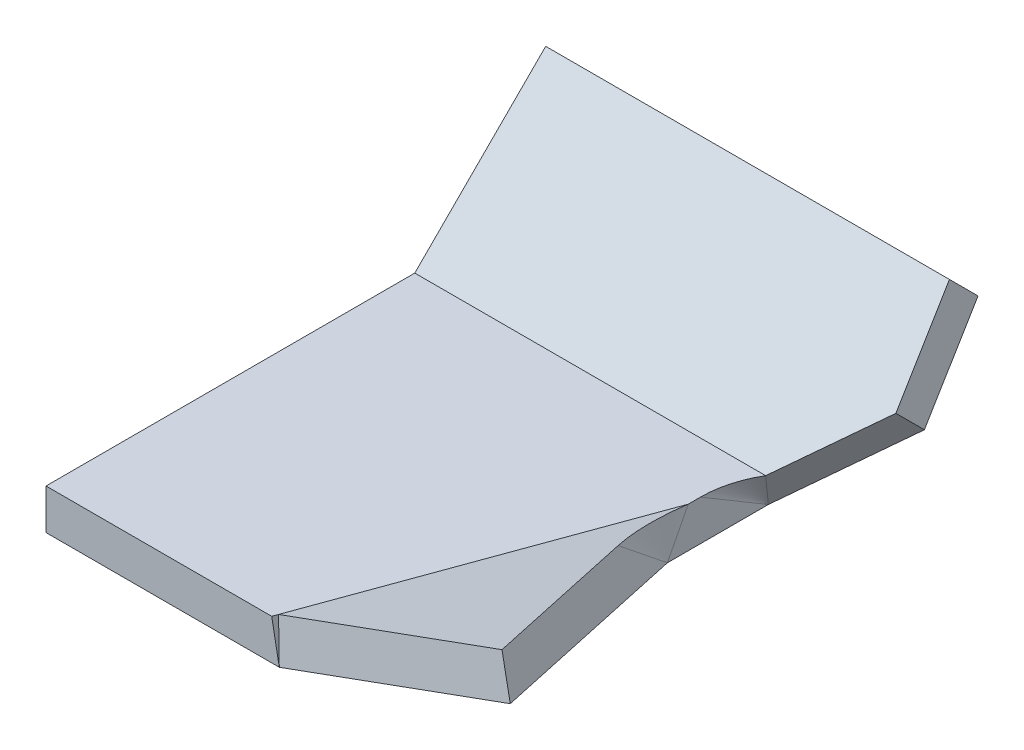
ISO-10303-21;
HEADER;
FILE_DESCRIPTION(('STEP AP214'),'2;1');
FILE_NAME('part.step','',(''),(''),'','','');
FILE_SCHEMA(('AUTOMOTIVE_DESIGN { 1 0 10303 214 1 1 1 1 }'));
ENDSEC;
DATA;
#1=APPLICATION_CONTEXT('core data for automotive mechanical design processes');
#2=APPLICATION_PROTOCOL_DEFINITION('international standard','automotive_design',2000,#1);
#3=PRODUCT_CONTEXT('',#1,'mechanical');
#4=PRODUCT('Part','Part','',(#3));
#5=PRODUCT_RELATED_PRODUCT_CATEGORY('part','',(#4));
#6=PRODUCT_DEFINITION_FORMATION('','',#4);
#7=PRODUCT_DEFINITION_CONTEXT('part definition',#1,'design');
#8=PRODUCT_DEFINITION('design','',#6,#7);
#9=PRODUCT_DEFINITION_SHAPE('','',#8);
#10=(LENGTH_UNIT() NAMED_UNIT(*) SI_UNIT(.MILLI.,.METRE.));
#11=(NAMED_UNIT(*) PLANE_ANGLE_UNIT() SI_UNIT($,.RADIAN.));
#12=(NAMED_UNIT(*) SI_UNIT($,.STERADIAN.) SOLID_ANGLE_UNIT());
#13=UNCERTAINTY_MEASURE_WITH_UNIT(LENGTH_MEASURE(1.E-05),#10,'distance_accuracy_value','');
#14=(GEOMETRIC_REPRESENTATION_CONTEXT(3) GLOBAL_UNCERTAINTY_ASSIGNED_CONTEXT((#13)) GLOBAL_UNIT_ASSIGNED_CONTEXT((#10,
#11,#12)) REPRESENTATION_CONTEXT('',''));
#15=CARTESIAN_POINT('',(0.,0.,0.));
#16=DIRECTION('',(0.,0.,1.));
#17=DIRECTION('',(1.,0.,0.));
#18=AXIS2_PLACEMENT_3D('',#15,#16,#17);
#19=CARTESIAN_POINT('',(0.,0.,0.));
#20=DIRECTION('',(-1.,0.,0.));
#21=DIRECTION('',(0.,0.,-1.));
#22=AXIS2_PLACEMENT_3D('',#19,#20,#21);
#23=PLANE('',#22);
#24=DIRECTION('',(0.,0.88883191143433,-0.458233382913112));
#25=VECTOR('',#24,1.);
#26=CARTESIAN_POINT('',(0.,10.,44.8445439793712));
#27=LINE('',#26,#25);
#28=CARTESIAN_POINT('',(0.,0.,50.));
#29=VERTEX_POINT('',#28);
#30=CARTESIAN_POINT('',(0.,20.,39.6890879587424));
#31=VERTEX_POINT('',#30);
#32=EDGE_CURVE('E309',#29,#31,#27,.T.);
#33=ORIENTED_EDGE('',*,*,#32,.F.);
#34=DIRECTION('',(0.,0.,-1.));
#35=VECTOR('',#34,1.);
#36=CARTESIAN_POINT('',(0.,0.,0.));
#37=LINE('',#36,#35);
#38=CARTESIAN_POINT('',(0.,0.,0.));
#39=VERTEX_POINT('',#38);
#40=EDGE_CURVE('E307',#29,#39,#37,.T.);
#41=ORIENTED_EDGE('',*,*,#40,.T.);
#42=DIRECTION('',(0.,-0.511228267578855,-0.859444971146101));
#43=VECTOR('',#42,1.);
#44=CARTESIAN_POINT('',(0.,10.,16.8113742069932));
#45=LINE('',#44,#43);
#46=CARTESIAN_POINT('',(0.,20.,33.6227484139865));
#47=VERTEX_POINT('',#46);
#48=EDGE_CURVE('E167',#47,#39,#45,.T.);
#49=ORIENTED_EDGE('',*,*,#48,.F.);
#50=DIRECTION('',(0.,0.,-1.));
#51=VECTOR('',#50,1.);
#52=CARTESIAN_POINT('',(0.,20.,0.));
#53=LINE('',#52,#51);
#54=EDGE_CURVE('E338',#31,#47,#53,.T.);
#55=ORIENTED_EDGE('',*,*,#54,.F.);
#56=EDGE_LOOP('',(#33,#41,#49,#55));
#57=FACE_BOUND('',#56,.T.);
#58=ADVANCED_FACE('F61',(#57),#23,.F.);
#59=CARTESIAN_POINT('',(41.9549815588638,35.3553390593274,-35.3553390593273));
#60=DIRECTION('',(-0.766044443118979,0.454519477672043,-0.454519477672042));
#61=DIRECTION('',(-0.642787609686538,-0.541675220419704,0.541675220419702));
#62=AXIS2_PLACEMENT_3D('',#59,#60,#61);
#63=PLANE('',#62);
#64=DIRECTION('',(-0.305733845240658,-0.879641425441802,-0.364359408443197));
#65=VECTOR('',#64,1.);
#66=CARTESIAN_POINT('',(6.95132894831783,20.,8.28427124746192));
#67=LINE('',#66,#65);
#68=CARTESIAN_POINT('',(6.95132894831783,20.,8.28427124746192));
#69=VERTEX_POINT('',#68);
#70=EDGE_CURVE('E173',#69,#39,#67,.T.);
#71=ORIENTED_EDGE('',*,*,#70,.T.);
#72=DIRECTION('',(-0.642787609686538,-0.541675220419704,0.541675220419702));
#73=VECTOR('',#72,1.);
#74=CARTESIAN_POINT('',(41.9549815588638,35.3553390593274,-35.3553390593273));
#75=LINE('',#74,#73);
#76=CARTESIAN_POINT('',(41.9549815588638,35.3553390593274,-35.3553390593273));
#77=VERTEX_POINT('',#76);
#78=EDGE_CURVE('E288',#77,#39,#75,.T.);
#79=ORIENTED_EDGE('',*,*,#78,.F.);
#80=DIRECTION('',(0.,-0.707106781186546,-0.707106781186549));
#81=VECTOR('',#80,1.);
#82=CARTESIAN_POINT('',(41.9549815588638,35.3553390593274,-35.3553390593273));
#83=LINE('',#82,#81);
#84=CARTESIAN_POINT('',(41.9549815588638,49.4974746830584,-21.2132034355963));
#85=VERTEX_POINT('',#84);
#86=EDGE_CURVE('E12',#85,#77,#83,.T.);
#87=ORIENTED_EDGE('',*,*,#86,.F.);
#88=DIRECTION('',(-0.642787609686538,-0.541675220419704,0.541675220419702));
#89=VECTOR('',#88,1.);
#90=CARTESIAN_POINT('',(41.9549815588638,49.4974746830584,-21.2132034355963));
#91=LINE('',#90,#89);
#92=EDGE_CURVE('E291',#85,#69,#91,.T.);
#93=ORIENTED_EDGE('',*,*,#92,.T.);
#94=EDGE_LOOP('',(#71,#79,#87,#93));
#95=FACE_BOUND('',#94,.T.);
#96=ADVANCED_FACE('F277',(#95),#63,.F.);
#97=CARTESIAN_POINT('',(0.,0.,50.));
#98=DIRECTION('',(-0.8662357634511,-0.241844762647975,0.437203285552654));
#99=DIRECTION('',(-0.38254623815515,-0.241844762647976,-0.891722763224696));
#100=AXIS2_PLACEMENT_3D('',#97,#98,#99);
#101=PLANE('',#100);
#102=DIRECTION('',(0.198129189759561,0.637032993641166,0.7449387821679));
#103=VECTOR('',#102,1.);
#104=CARTESIAN_POINT('',(0.,0.,50.));
#105=LINE('',#104,#103);
#106=CARTESIAN_POINT('',(8.84907420148737,28.4519016928662,83.2713143730566));
#107=VERTEX_POINT('',#106);
#108=EDGE_CURVE('E80',#29,#107,#105,.T.);
#109=ORIENTED_EDGE('',*,*,#108,.T.);
#110=DIRECTION('',(-0.38254623815515,-0.241844762647976,-0.891722763224696));
#111=VECTOR('',#110,1.);
#112=CARTESIAN_POINT('',(-6.4278760968654,18.7938524157182,47.6604444311898));
#113=LINE('',#112,#111);
#114=CARTESIAN_POINT('',(52.0660426463178,55.7735596610884,184.010913083184));
#115=VERTEX_POINT('',#114);
#116=EDGE_CURVE('E166',#115,#107,#113,.T.);
#117=ORIENTED_EDGE('',*,*,#116,.F.);
#118=DIRECTION('',(0.32139380484327,-0.939692620785908,0.116977778440512));
#119=VECTOR('',#118,1.);
#120=CARTESIAN_POINT('',(58.4939187431832,36.9797072453703,186.350468651994));
#121=LINE('',#120,#119);
#122=CARTESIAN_POINT('',(58.4939187431832,36.9797072453703,186.350468651994));
#123=VERTEX_POINT('',#122);
#124=EDGE_CURVE('E72',#115,#123,#121,.T.);
#125=ORIENTED_EDGE('',*,*,#124,.T.);
#126=DIRECTION('',(-0.38254623815515,-0.241844762647976,-0.891722763224696));
#127=VECTOR('',#126,1.);
#128=CARTESIAN_POINT('',(0.,0.,50.));
#129=LINE('',#128,#127);
#130=EDGE_CURVE('E326',#123,#29,#129,.T.);
#131=ORIENTED_EDGE('',*,*,#130,.T.);
#132=EDGE_LOOP('',(#109,#117,#125,#131));
#133=FACE_BOUND('',#132,.T.);
#134=ADVANCED_FACE('F274',(#133),#101,.F.);
#135=CARTESIAN_POINT('',(58.4939187431832,36.9797072453703,186.350468651994));
#136=DIRECTION('',(0.,-0.123531673829375,-0.992340629804561));
#137=DIRECTION('',(0.946945627904985,0.318932130713455,-0.0397023146706805));
#138=AXIS2_PLACEMENT_3D('',#135,#136,#137);
#139=PLANE('',#138);
#140=ORIENTED_EDGE('',*,*,#124,.F.);
#141=DIRECTION('',(0.946945627904985,0.318932130713455,-0.0397023146706805));
#142=VECTOR('',#141,1.);
#143=CARTESIAN_POINT('',(52.0660426463178,55.7735596610884,184.010913083184));
#144=LINE('',#143,#142);
#145=CARTESIAN_POINT('',(-54.1497087735397,20.,188.464190084086));
#146=VERTEX_POINT('',#145);
#147=EDGE_CURVE('E136',#146,#115,#144,.T.);
#148=ORIENTED_EDGE('',*,*,#147,.F.);
#149=DIRECTION('',(0.139856003647902,-0.982587760105609,0.122317586365492));
#150=VECTOR('',#149,1.);
#151=CARTESIAN_POINT('',(-54.1497087735397,20.,188.464190084086));
#152=LINE('',#151,#150);
#153=CARTESIAN_POINT('',(-51.3030214988504,0.,190.953893117886));
#154=VERTEX_POINT('',#153);
#155=EDGE_CURVE('E151',#146,#154,#152,.T.);
#156=ORIENTED_EDGE('',*,*,#155,.T.);
#157=DIRECTION('',(0.946945627904985,0.318932130713455,-0.0397023146706805));
#158=VECTOR('',#157,1.);
#159=CARTESIAN_POINT('',(58.4939187431832,36.9797072453703,186.350468651994));
#160=LINE('',#159,#158);
#161=EDGE_CURVE('E331',#154,#123,#160,.T.);
#162=ORIENTED_EDGE('',*,*,#161,.T.);
#163=EDGE_LOOP('',(#140,#148,#156,#162));
#164=FACE_BOUND('',#163,.T.);
#165=ADVANCED_FACE('F165',(#164),#139,.F.);
#166=CARTESIAN_POINT('',(12.7558269898195,20.,4.64274133774375));
#167=DIRECTION('',(0.925416578398323,0.173648177666931,0.336824088833466));
#168=DIRECTION('',(0.163175911166535,-0.984807753012208,0.059391174613885));
#169=AXIS2_PLACEMENT_3D('',#166,#167,#168);
#170=PLANE('',#169);
#171=ORIENTED_EDGE('',*,*,#155,.F.);
#172=DIRECTION('',(0.34202014332567,0.,-0.939692620785908));
#173=VECTOR('',#172,1.);
#174=CARTESIAN_POINT('',(12.7558269898195,20.,4.64274133774375));
#175=LINE('',#174,#173);
#176=CARTESIAN_POINT('',(-55.0558865700052,20.,190.953893117886));
#177=VERTEX_POINT('',#176);
#178=EDGE_CURVE('E146',#177,#146,#175,.T.);
#179=ORIENTED_EDGE('',*,*,#178,.F.);
#180=DIRECTION('',(0.184424547807917,-0.982846674800218,0.));
#181=VECTOR('',#180,1.);
#182=CARTESIAN_POINT('',(-55.0558865700052,20.,190.953893117886));
#183=LINE('',#182,#181);
#184=EDGE_CURVE('E153',#177,#154,#183,.T.);
#185=ORIENTED_EDGE('',*,*,#184,.T.);
#186=EDGE_LOOP('',(#171,#179,#185));
#187=FACE_BOUND('',#186,.T.);
#188=ADVANCED_FACE('F152',(#187),#170,.T.);
#189=CARTESIAN_POINT('',(-51.3030214988504,0.,190.953893117886));
#190=DIRECTION('',(0.,0.,-1.));
#191=DIRECTION('',(1.,0.,0.));
#192=AXIS2_PLACEMENT_3D('',#189,#190,#191);
#193=PLANE('',#192);
#194=ORIENTED_EDGE('',*,*,#184,.F.);
#195=DIRECTION('',(1.,0.,0.));
#196=VECTOR('',#195,1.);
#197=CARTESIAN_POINT('',(0.,20.,190.953893117886));
#198=LINE('',#197,#196);
#199=CARTESIAN_POINT('',(-166.861367476559,20.,190.953893117886));
#200=VERTEX_POINT('',#199);
#201=EDGE_CURVE('E162',#200,#177,#198,.T.);
#202=ORIENTED_EDGE('',*,*,#201,.F.);
#203=DIRECTION('',(0.,-1.,0.));
#204=VECTOR('',#203,1.);
#205=CARTESIAN_POINT('',(-166.861367476559,0.,190.953893117886));
#206=LINE('',#205,#204);
#207=CARTESIAN_POINT('',(-166.861367476559,0.,190.953893117886));
#208=VERTEX_POINT('',#207);
#209=EDGE_CURVE('E367',#200,#208,#206,.T.);
#210=ORIENTED_EDGE('',*,*,#209,.T.);
#211=DIRECTION('',(1.,0.,0.));
#212=VECTOR('',#211,1.);
#213=CARTESIAN_POINT('',(-51.3030214988504,0.,190.953893117886));
#214=LINE('',#213,#212);
#215=EDGE_CURVE('E325',#208,#154,#214,.T.);
#216=ORIENTED_EDGE('',*,*,#215,.T.);
#217=EDGE_LOOP('',(#194,#202,#210,#216));
#218=FACE_BOUND('',#217,.T.);
#219=ADVANCED_FACE('F266',(#218),#193,.F.);
#220=CARTESIAN_POINT('',(-166.861367476559,0.,0.));
#221=DIRECTION('',(1.,0.,0.));
#222=DIRECTION('',(0.,0.707106781186549,-0.707106781186546));
#223=AXIS2_PLACEMENT_3D('',#220,#221,#222);
#224=PLANE('',#223);
#225=DIRECTION('',(0.,0.707106781186549,-0.707106781186546));
#226=VECTOR('',#225,1.);
#227=CARTESIAN_POINT('',(-166.861367476559,0.,0.));
#228=LINE('',#227,#226);
#229=CARTESIAN_POINT('',(-166.861367476559,0.,0.));
#230=VERTEX_POINT('',#229);
#231=CARTESIAN_POINT('',(-166.861367476559,70.7106781186549,-70.7106781186547));
#232=VERTEX_POINT('',#231);
#233=EDGE_CURVE('E318',#230,#232,#228,.T.);
#234=ORIENTED_EDGE('',*,*,#233,.F.);
#235=DIRECTION('',(0.,0.,1.));
#236=VECTOR('',#235,1.);
#237=CARTESIAN_POINT('',(-166.861367476559,0.,190.953893117886));
#238=LINE('',#237,#236);
#239=EDGE_CURVE('E317',#230,#208,#238,.T.);
#240=ORIENTED_EDGE('',*,*,#239,.T.);
#241=ORIENTED_EDGE('',*,*,#209,.F.);
#242=DIRECTION('',(0.,0.,-1.));
#243=VECTOR('',#242,1.);
#244=CARTESIAN_POINT('',(-166.861367476559,20.,0.));
#245=LINE('',#244,#243);
#246=CARTESIAN_POINT('',(-166.861367476559,20.,8.28427124746192));
#247=VERTEX_POINT('',#246);
#248=EDGE_CURVE('E169',#247,#200,#245,.F.);
#249=ORIENTED_EDGE('',*,*,#248,.F.);
#250=DIRECTION('',(0.,-0.707106781186549,0.707106781186546));
#251=VECTOR('',#250,1.);
#252=CARTESIAN_POINT('',(-166.861367476559,14.1421356237309,14.142135623731));
#253=LINE('',#252,#251);
#254=CARTESIAN_POINT('',(-166.861367476559,84.8528137423858,-56.5685424949237));
#255=VERTEX_POINT('',#254);
#256=EDGE_CURVE('E163',#247,#255,#253,.F.);
#257=ORIENTED_EDGE('',*,*,#256,.T.);
#258=DIRECTION('',(0.,-0.707106781186546,-0.707106781186549));
#259=VECTOR('',#258,1.);
#260=CARTESIAN_POINT('',(-166.861367476559,70.7106781186549,-70.7106781186547));
#261=LINE('',#260,#259);
#262=EDGE_CURVE('E89',#255,#232,#261,.T.);
#263=ORIENTED_EDGE('',*,*,#262,.T.);
#264=EDGE_LOOP('',(#234,#240,#241,#249,#257,#263));
#265=FACE_BOUND('',#264,.T.);
#266=ADVANCED_FACE('F262',(#265),#224,.F.);
#267=CARTESIAN_POINT('',(-166.861367476559,70.7106781186549,-70.7106781186547));
#268=DIRECTION('',(0.,-0.707106781186549,0.707106781186546));
#269=DIRECTION('',(1.,0.,0.));
#270=AXIS2_PLACEMENT_3D('',#267,#268,#269);
#271=PLANE('',#270);
#272=ORIENTED_EDGE('',*,*,#262,.F.);
#273=DIRECTION('',(1.,0.,0.));
#274=VECTOR('',#273,1.);
#275=CARTESIAN_POINT('',(0.,84.8528137423858,-56.5685424949237));
#276=LINE('',#275,#274);
#277=CARTESIAN_POINT('',(33.1386325234408,84.8528137423858,-56.5685424949237));
#278=VERTEX_POINT('',#277);
#279=EDGE_CURVE('E334',#255,#278,#276,.T.);
#280=ORIENTED_EDGE('',*,*,#279,.T.);
#281=DIRECTION('',(0.,-0.707106781186546,-0.707106781186549));
#282=VECTOR('',#281,1.);
#283=CARTESIAN_POINT('',(33.1386325234408,70.7106781186549,-70.7106781186547));
#284=LINE('',#283,#282);
#285=CARTESIAN_POINT('',(33.1386325234408,70.7106781186549,-70.7106781186547));
#286=VERTEX_POINT('',#285);
#287=EDGE_CURVE('E320',#278,#286,#284,.T.);
#288=ORIENTED_EDGE('',*,*,#287,.T.);
#289=DIRECTION('',(1.,0.,0.));
#290=VECTOR('',#289,1.);
#291=CARTESIAN_POINT('',(-166.861367476559,70.7106781186549,-70.7106781186547));
#292=LINE('',#291,#290);
#293=EDGE_CURVE('E312',#232,#286,#292,.T.);
#294=ORIENTED_EDGE('',*,*,#293,.F.);
#295=EDGE_LOOP('',(#272,#280,#288,#294));
#296=FACE_BOUND('',#295,.T.);
#297=ADVANCED_FACE('F259',(#296),#271,.F.);
#298=CARTESIAN_POINT('',(33.1386325234408,70.7106781186549,-70.7106781186547));
#299=DIRECTION('',(-0.984807753012209,-0.12278780396897,0.12278780396897));
#300=DIRECTION('',(0.173648177666926,-0.696364240320021,0.696364240320018));
#301=AXIS2_PLACEMENT_3D('',#298,#299,#300);
#302=PLANE('',#301);
#303=DIRECTION('',(0.173648177666926,-0.696364240320021,0.696364240320018));
#304=VECTOR('',#303,1.);
#305=CARTESIAN_POINT('',(33.1386325234408,84.8528137423858,-56.5685424949237));
#306=LINE('',#305,#304);
#307=EDGE_CURVE('E337',#278,#85,#306,.T.);
#308=ORIENTED_EDGE('',*,*,#307,.T.);
#309=ORIENTED_EDGE('',*,*,#86,.T.);
#310=DIRECTION('',(0.173648177666926,-0.696364240320021,0.696364240320018));
#311=VECTOR('',#310,1.);
#312=CARTESIAN_POINT('',(33.1386325234408,70.7106781186549,-70.7106781186547));
#313=LINE('',#312,#311);
#314=EDGE_CURVE('E302',#286,#77,#313,.T.);
#315=ORIENTED_EDGE('',*,*,#314,.F.);
#316=ORIENTED_EDGE('',*,*,#287,.F.);
#317=EDGE_LOOP('',(#308,#309,#315,#316));
#318=FACE_BOUND('',#317,.T.);
#319=ADVANCED_FACE('F63',(#318),#302,.F.);
#320=CARTESIAN_POINT('',(0.,0.,0.));
#321=DIRECTION('',(0.,0.707106781186546,0.707106781186549));
#322=DIRECTION('',(0.,-0.707106781186549,0.707106781186546));
#323=AXIS2_PLACEMENT_3D('',#320,#321,#322);
#324=PLANE('',#323);
#325=ORIENTED_EDGE('',*,*,#293,.T.);
#326=ORIENTED_EDGE('',*,*,#314,.T.);
#327=ORIENTED_EDGE('',*,*,#78,.T.);
#328=DIRECTION('',(-1.,0.,0.));
#329=VECTOR('',#328,1.);
#330=CARTESIAN_POINT('',(0.,0.,0.));
#331=LINE('',#330,#329);
#332=EDGE_CURVE('E300',#39,#230,#331,.T.);
#333=ORIENTED_EDGE('',*,*,#332,.T.);
#334=ORIENTED_EDGE('',*,*,#233,.T.);
#335=EDGE_LOOP('',(#325,#326,#327,#333,#334));
#336=FACE_BOUND('',#335,.T.);
#337=ADVANCED_FACE('F234',(#336),#324,.F.);
#338=CARTESIAN_POINT('',(0.,0.,0.));
#339=DIRECTION('',(0.,-1.,0.));
#340=DIRECTION('',(0.,0.,-1.));
#341=AXIS2_PLACEMENT_3D('',#338,#339,#340);
#342=PLANE('',#341);
#343=ORIENTED_EDGE('',*,*,#239,.F.);
#344=ORIENTED_EDGE('',*,*,#332,.F.);
#345=ORIENTED_EDGE('',*,*,#40,.F.);
#346=DIRECTION('',(0.34202014332567,0.,-0.939692620785908));
#347=VECTOR('',#346,1.);
#348=CARTESIAN_POINT('',(0.,0.,50.));
#349=LINE('',#348,#347);
#350=EDGE_CURVE('E313',#154,#29,#349,.T.);
#351=ORIENTED_EDGE('',*,*,#350,.F.);
#352=ORIENTED_EDGE('',*,*,#215,.F.);
#353=EDGE_LOOP('',(#343,#344,#345,#351,#352));
#354=FACE_BOUND('',#353,.T.);
#355=ADVANCED_FACE('F242',(#354),#342,.T.);
#356=CARTESIAN_POINT('',(1.87979666475545,-5.49615775982388,0.684190032443871));
#357=DIRECTION('',(0.32139380484327,-0.939692620785908,0.116977778440512));
#358=DIRECTION('',(0.946188648339465,0.323615577118185,0.));
#359=AXIS2_PLACEMENT_3D('',#356,#357,#358);
#360=PLANE('',#359);
#361=ORIENTED_EDGE('',*,*,#161,.F.);
#362=ORIENTED_EDGE('',*,*,#350,.T.);
#363=ORIENTED_EDGE('',*,*,#130,.F.);
#364=EDGE_LOOP('',(#361,#362,#363));
#365=FACE_BOUND('',#364,.T.);
#366=ADVANCED_FACE('F246',(#365),#360,.T.);
#367=CARTESIAN_POINT('',(0.,14.1421356237309,14.142135623731));
#368=DIRECTION('',(0.,0.707106781186546,0.707106781186549));
#369=DIRECTION('',(0.,-0.707106781186549,0.707106781186546));
#370=AXIS2_PLACEMENT_3D('',#367,#368,#369);
#371=PLANE('',#370);
#372=ORIENTED_EDGE('',*,*,#279,.F.);
#373=ORIENTED_EDGE('',*,*,#256,.F.);
#374=DIRECTION('',(-1.,0.,0.));
#375=VECTOR('',#374,1.);
#376=CARTESIAN_POINT('',(0.,20.,8.28427124746192));
#377=LINE('',#376,#375);
#378=EDGE_CURVE('E145',#69,#247,#377,.T.);
#379=ORIENTED_EDGE('',*,*,#378,.F.);
#380=ORIENTED_EDGE('',*,*,#92,.F.);
#381=ORIENTED_EDGE('',*,*,#307,.F.);
#382=EDGE_LOOP('',(#372,#373,#379,#380,#381));
#383=FACE_BOUND('',#382,.T.);
#384=ADVANCED_FACE('F250',(#383),#371,.T.);
#385=CARTESIAN_POINT('',(0.,20.,0.));
#386=DIRECTION('',(0.,-1.,0.));
#387=DIRECTION('',(0.,0.,-1.));
#388=AXIS2_PLACEMENT_3D('',#385,#386,#387);
#389=PLANE('',#388);
#390=ORIENTED_EDGE('',*,*,#248,.T.);
#391=ORIENTED_EDGE('',*,*,#201,.T.);
#392=ORIENTED_EDGE('',*,*,#178,.T.);
#393=DIRECTION('',(0.34202014332567,0.,-0.939692620785908));
#394=VECTOR('',#393,1.);
#395=CARTESIAN_POINT('',(12.7558269898195,20.,4.64274133774375));
#396=LINE('',#395,#394);
#397=EDGE_CURVE('E132',#146,#31,#396,.T.);
#398=ORIENTED_EDGE('',*,*,#397,.T.);
#399=ORIENTED_EDGE('',*,*,#54,.T.);
#400=CARTESIAN_POINT('',(49.6566487069548,20.,33.6227484139865));
#401=DIRECTION('',(0.,-1.,0.));
#402=DIRECTION('',(0.,0.,-1.));
#403=AXIS2_PLACEMENT_3D('',#400,#401,#402);
#404=CIRCLE('',#403,49.6566487069548);
#405=EDGE_CURVE('E202',#47,#69,#404,.T.);
#406=ORIENTED_EDGE('',*,*,#405,.T.);
#407=ORIENTED_EDGE('',*,*,#378,.T.);
#408=EDGE_LOOP('',(#390,#391,#392,#398,#399,#406,#407));
#409=FACE_BOUND('',#408,.T.);
#410=ADVANCED_FACE('F160',(#409),#389,.F.);
#411=CARTESIAN_POINT('',(-4.54807943210995,13.2976946558943,-1.65536553636636));
#412=DIRECTION('',(0.32139380484327,-0.939692620785908,0.116977778440512));
#413=DIRECTION('',(0.946188648339465,0.323615577118185,0.));
#414=AXIS2_PLACEMENT_3D('',#411,#412,#413);
#415=PLANE('',#414);
#416=ORIENTED_EDGE('',*,*,#116,.T.);
#417=CARTESIAN_POINT('',(103.82364265886,54.9678953002623,35.336104208009));
#418=DIRECTION('',(0.32139380484327,-0.939692620785908,0.116977778440512));
#419=DIRECTION('',(0.946188648339465,0.323615577118185,0.));
#420=AXIS2_PLACEMENT_3D('',#417,#418,#419);
#421=CIRCLE('',#420,109.640553374283);
#422=EDGE_CURVE('E139',#107,#31,#421,.T.);
#423=ORIENTED_EDGE('',*,*,#422,.T.);
#424=ORIENTED_EDGE('',*,*,#397,.F.);
#425=ORIENTED_EDGE('',*,*,#147,.T.);
#426=EDGE_LOOP('',(#416,#423,#424,#425));
#427=FACE_BOUND('',#426,.T.);
#428=ADVANCED_FACE('F134',(#427),#415,.F.);
#429=CARTESIAN_POINT('',(6.95132894831781,20.,8.28427124746195));
#430=CARTESIAN_POINT('',(0.,0.,0.));
#431=CARTESIAN_POINT('',(5.83405549628667,20.,10.1673173245112));
#432=CARTESIAN_POINT('',(0.,0.,0.));
#433=CARTESIAN_POINT('',(4.83183359292781,20.,12.1415099465489));
#434=CARTESIAN_POINT('',(0.,0.,0.));
#435=CARTESIAN_POINT('',(3.09432009081938,20.,16.2257024019579));
#436=CARTESIAN_POINT('',(0.,0.,0.));
#437=CARTESIAN_POINT('',(2.35913982718852,20.,18.3355617003498));
#438=CARTESIAN_POINT('',(0.,0.,0.));
#439=CARTESIAN_POINT('',(1.17956991359426,20.,22.6352438969692));
#440=CARTESIAN_POINT('',(0.,0.,0.));
#441=CARTESIAN_POINT('',(0.735228340152636,20.,24.8248915501669));
#442=CARTESIAN_POINT('',(0.,0.,0.));
#443=CARTESIAN_POINT('',(0.145455402485951,20.,29.2239538439774));
#444=CARTESIAN_POINT('',(0.,0.,0.));
#445=CARTESIAN_POINT('',(0.,20.,31.433190811432));
#446=CARTESIAN_POINT('',(0.,0.,0.));
#447=CARTESIAN_POINT('',(0.,20.,33.6227484139865));
#448=CARTESIAN_POINT('',(0.,0.,0.));
#449=B_SPLINE_SURFACE_WITH_KNOTS('',3,1,((#429,#430),(#431,#432),(#433,#434),(#435,#436),(#437,
#438),(#439,#440),(#441,#442),(#443,#444),(#445,#446),(#447,#448)),.UNSPECIFIED.,.F.,.F.,.F.,(4,
2,2,2,4),(2,2),(0.,0.25,0.5,0.75,1.),(0.,1.),.UNSPECIFIED.);
#450=ORIENTED_EDGE('',*,*,#405,.F.);
#451=ORIENTED_EDGE('',*,*,#48,.T.);
#452=ORIENTED_EDGE('',*,*,#70,.F.);
#453=EDGE_LOOP('',(#450,#451,#452));
#454=FACE_BOUND('',#453,.T.);
#455=ADVANCED_FACE('F218',(#454),#449,.T.);
#456=CARTESIAN_POINT('',(0.,0.,50.));
#457=CARTESIAN_POINT('',(8.84907420148734,28.4519016928662,83.2713143730566));
#458=CARTESIAN_POINT('',(0.,0.,50.));
#459=CARTESIAN_POINT('',(7.40599657452022,27.5395916728813,79.9074721999571));
#460=CARTESIAN_POINT('',(0.,0.,50.));
#461=CARTESIAN_POINT('',(6.12419904205018,26.6695514861801,76.4400738390164));
#462=CARTESIAN_POINT('',(0.,0.,50.));
#463=CARTESIAN_POINT('',(3.91207719280653,25.0303345923855,69.3498574567419));
#464=CARTESIAN_POINT('',(0.,0.,50.));
#465=CARTESIAN_POINT('',(2.98180533978013,24.2611875054496,65.7271332337356));
#466=CARTESIAN_POINT('',(0.,0.,50.));
#467=CARTESIAN_POINT('',(1.49090266989006,22.8372009377446,58.3843472833213));
#468=CARTESIAN_POINT('',(0.,0.,50.));
#469=CARTESIAN_POINT('',(0.930293823144256,22.1823824410098,54.6643937600746));
#470=CARTESIAN_POINT('',(0.,0.,50.));
#471=CARTESIAN_POINT('',(0.184847980728687,20.9967759904935,47.1884101265454));
#472=CARTESIAN_POINT('',(0.,0.,50.));
#473=CARTESIAN_POINT('',(0.,20.4659980335571,43.4324905029876));
#474=CARTESIAN_POINT('',(0.,0.,50.));
#475=CARTESIAN_POINT('',(0.,20.,39.6890879587424));
#476=B_SPLINE_SURFACE_WITH_KNOTS('',3,1,((#456,#457),(#458,#459),(#460,#461),(#462,#463),(#464,
#465),(#466,#467),(#468,#469),(#470,#471),(#472,#473),(#474,#475)),.UNSPECIFIED.,.F.,.F.,.F.,(4,
2,2,2,4),(2,2),(0.,0.25,0.5,0.75,1.),(0.,1.),.UNSPECIFIED.);
#477=ORIENTED_EDGE('',*,*,#32,.T.);
#478=ORIENTED_EDGE('',*,*,#422,.F.);
#479=ORIENTED_EDGE('',*,*,#108,.F.);
#480=EDGE_LOOP('',(#477,#478,#479));
#481=FACE_BOUND('',#480,.T.);
#482=ADVANCED_FACE('F230',(#481),#476,.T.);
#483=CLOSED_SHELL('',(#58,#96,#134,#165,#188,#219,#266,#297,#319,#337,#355,#366,#384,#410,#428,
#455,#482));
#484=MANIFOLD_SOLID_BREP('B2',#483);
#485=ADVANCED_BREP_SHAPE_REPRESENTATION('',(#18,#484),#14);
#486=SHAPE_DEFINITION_REPRESENTATION(#9,#485);
ENDSEC;
END-ISO-10303-21;
